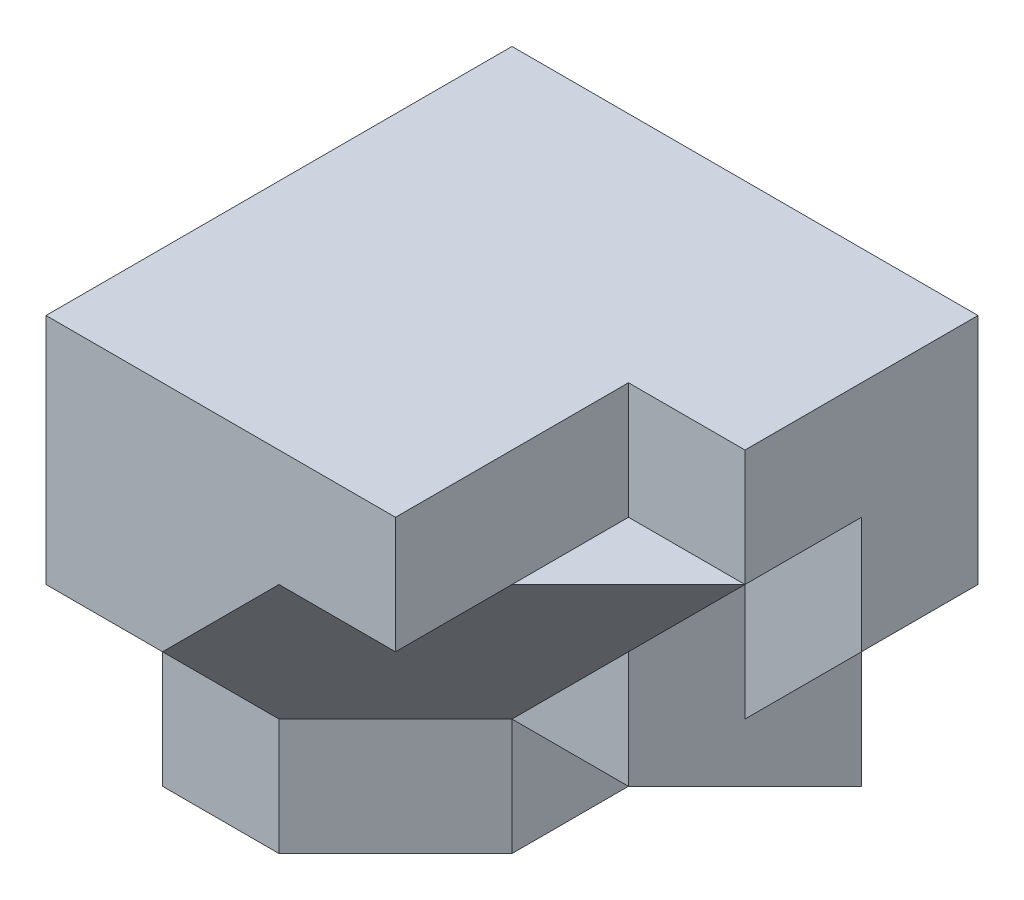
ISO-10303-21;
HEADER;
FILE_DESCRIPTION(('STEP AP214'),'2;1');
FILE_NAME('part.step','',(''),(''),'','','');
FILE_SCHEMA(('AUTOMOTIVE_DESIGN { 1 0 10303 214 1 1 1 1 }'));
ENDSEC;
DATA;
#1=APPLICATION_CONTEXT('core data for automotive mechanical design processes');
#2=APPLICATION_PROTOCOL_DEFINITION('international standard','automotive_design',2000,#1);
#3=PRODUCT_CONTEXT('',#1,'mechanical');
#4=PRODUCT('Part','Part','',(#3));
#5=PRODUCT_RELATED_PRODUCT_CATEGORY('part','',(#4));
#6=PRODUCT_DEFINITION_FORMATION('','',#4);
#7=PRODUCT_DEFINITION_CONTEXT('part definition',#1,'design');
#8=PRODUCT_DEFINITION('design','',#6,#7);
#9=PRODUCT_DEFINITION_SHAPE('','',#8);
#10=(LENGTH_UNIT() NAMED_UNIT(*) SI_UNIT(.MILLI.,.METRE.));
#11=(NAMED_UNIT(*) PLANE_ANGLE_UNIT() SI_UNIT($,.RADIAN.));
#12=(NAMED_UNIT(*) SI_UNIT($,.STERADIAN.) SOLID_ANGLE_UNIT());
#13=UNCERTAINTY_MEASURE_WITH_UNIT(LENGTH_MEASURE(1.E-05),#10,'distance_accuracy_value','');
#14=(GEOMETRIC_REPRESENTATION_CONTEXT(3) GLOBAL_UNCERTAINTY_ASSIGNED_CONTEXT((#13)) GLOBAL_UNIT_ASSIGNED_CONTEXT((#10,
#11,#12)) REPRESENTATION_CONTEXT('',''));
#15=CARTESIAN_POINT('',(0.,0.,0.));
#16=DIRECTION('',(0.,0.,1.));
#17=DIRECTION('',(1.,0.,0.));
#18=AXIS2_PLACEMENT_3D('',#15,#16,#17);
#19=CARTESIAN_POINT('',(0.,30.,40.));
#20=DIRECTION('',(0.,1.,0.));
#21=DIRECTION('',(0.,0.,1.));
#22=AXIS2_PLACEMENT_3D('',#19,#20,#21);
#23=PLANE('',#22);
#24=DIRECTION('',(0.707106781186547,0.,-0.707106781186548));
#25=VECTOR('',#24,1.);
#26=CARTESIAN_POINT('',(40.,30.,20.));
#27=LINE('',#26,#25);
#28=CARTESIAN_POINT('',(20.,30.,40.));
#29=VERTEX_POINT('',#28);
#30=CARTESIAN_POINT('',(30.,30.,30.));
#31=VERTEX_POINT('',#30);
#32=EDGE_CURVE('E168',#29,#31,#27,.T.);
#33=ORIENTED_EDGE('',*,*,#32,.T.);
#34=DIRECTION('',(0.,0.,-1.));
#35=VECTOR('',#34,1.);
#36=CARTESIAN_POINT('',(30.,30.,40.));
#37=LINE('',#36,#35);
#38=CARTESIAN_POINT('',(30.,30.,40.));
#39=VERTEX_POINT('',#38);
#40=EDGE_CURVE('E247',#39,#31,#37,.T.);
#41=ORIENTED_EDGE('',*,*,#40,.F.);
#42=DIRECTION('',(1.,0.,0.));
#43=VECTOR('',#42,1.);
#44=CARTESIAN_POINT('',(0.,30.,40.));
#45=LINE('',#44,#43);
#46=EDGE_CURVE('E249',#29,#39,#45,.T.);
#47=ORIENTED_EDGE('',*,*,#46,.F.);
#48=EDGE_LOOP('',(#33,#41,#47));
#49=FACE_BOUND('',#48,.T.);
#50=ADVANCED_FACE('F36',(#49),#23,.F.);
#51=CARTESIAN_POINT('',(0.,0.,20.));
#52=DIRECTION('',(0.,0.,-1.));
#53=DIRECTION('',(-1.,0.,0.));
#54=AXIS2_PLACEMENT_3D('',#51,#52,#53);
#55=PLANE('',#54);
#56=DIRECTION('',(-0.707106781186547,-0.707106781186548,0.));
#57=VECTOR('',#56,1.);
#58=CARTESIAN_POINT('',(5.00000000000001,-5.00000000000001,20.));
#59=LINE('',#58,#57);
#60=CARTESIAN_POINT('',(30.,20.,20.));
#61=VERTEX_POINT('',#60);
#62=CARTESIAN_POINT('',(20.,9.99999999999999,20.));
#63=VERTEX_POINT('',#62);
#64=EDGE_CURVE('E196',#61,#63,#59,.T.);
#65=ORIENTED_EDGE('',*,*,#64,.T.);
#66=DIRECTION('',(-1.,0.,0.));
#67=VECTOR('',#66,1.);
#68=CARTESIAN_POINT('',(30.,10.,20.));
#69=LINE('',#68,#67);
#70=CARTESIAN_POINT('',(30.,10.,20.));
#71=VERTEX_POINT('',#70);
#72=EDGE_CURVE('E284',#71,#63,#69,.T.);
#73=ORIENTED_EDGE('',*,*,#72,.F.);
#74=DIRECTION('',(0.,1.,0.));
#75=VECTOR('',#74,1.);
#76=CARTESIAN_POINT('',(30.,10.,20.));
#77=LINE('',#76,#75);
#78=EDGE_CURVE('E270',#71,#61,#77,.T.);
#79=ORIENTED_EDGE('',*,*,#78,.T.);
#80=EDGE_LOOP('',(#65,#73,#79));
#81=FACE_BOUND('',#80,.T.);
#82=ADVANCED_FACE('F351',(#81),#55,.F.);
#83=CARTESIAN_POINT('',(5.,-5.,0.));
#84=DIRECTION('',(0.707106781186548,-0.707106781186548,0.));
#85=DIRECTION('',(0.707106781186548,0.707106781186548,0.));
#86=AXIS2_PLACEMENT_3D('',#83,#84,#85);
#87=PLANE('',#86);
#88=DIRECTION('',(0.,0.,1.));
#89=VECTOR('',#88,1.);
#90=CARTESIAN_POINT('',(30.,20.,0.));
#91=LINE('',#90,#89);
#92=CARTESIAN_POINT('',(30.,20.,10.));
#93=VERTEX_POINT('',#92);
#94=EDGE_CURVE('E274',#93,#61,#91,.T.);
#95=ORIENTED_EDGE('',*,*,#94,.F.);
#96=DIRECTION('',(0.707106781186548,0.707106781186547,0.));
#97=VECTOR('',#96,1.);
#98=CARTESIAN_POINT('',(30.,20.,10.));
#99=LINE('',#98,#97);
#100=CARTESIAN_POINT('',(40.,30.,10.));
#101=VERTEX_POINT('',#100);
#102=EDGE_CURVE('E52',#93,#101,#99,.T.);
#103=ORIENTED_EDGE('',*,*,#102,.T.);
#104=DIRECTION('',(0.,0.,1.));
#105=VECTOR('',#104,1.);
#106=CARTESIAN_POINT('',(40.,30.,0.));
#107=LINE('',#106,#105);
#108=CARTESIAN_POINT('',(40.,30.,20.));
#109=VERTEX_POINT('',#108);
#110=EDGE_CURVE('E183',#101,#109,#107,.T.);
#111=ORIENTED_EDGE('',*,*,#110,.T.);
#112=DIRECTION('',(0.707106781186548,0.707106781186548,0.));
#113=VECTOR('',#112,1.);
#114=CARTESIAN_POINT('',(5.,-5.,20.));
#115=LINE('',#114,#113);
#116=EDGE_CURVE('E189',#61,#109,#115,.T.);
#117=ORIENTED_EDGE('',*,*,#116,.F.);
#118=EDGE_LOOP('',(#95,#103,#111,#117));
#119=FACE_BOUND('',#118,.T.);
#120=ADVANCED_FACE('F188',(#119),#87,.T.);
#121=CARTESIAN_POINT('',(20.,0.,0.));
#122=DIRECTION('',(1.,0.,0.));
#123=DIRECTION('',(0.,0.,-1.));
#124=AXIS2_PLACEMENT_3D('',#121,#122,#123);
#125=PLANE('',#124);
#126=DIRECTION('',(0.,0.,1.));
#127=VECTOR('',#126,1.);
#128=CARTESIAN_POINT('',(20.,0.,0.));
#129=LINE('',#128,#127);
#130=CARTESIAN_POINT('',(20.,0.,0.));
#131=VERTEX_POINT('',#130);
#132=CARTESIAN_POINT('',(20.,0.,20.));
#133=VERTEX_POINT('',#132);
#134=EDGE_CURVE('E191',#131,#133,#129,.T.);
#135=ORIENTED_EDGE('',*,*,#134,.F.);
#136=DIRECTION('',(0.,-0.447213595499958,-0.894427190999916));
#137=VECTOR('',#136,1.);
#138=CARTESIAN_POINT('',(20.,0.,0.));
#139=LINE('',#138,#137);
#140=EDGE_CURVE('E276',#63,#131,#139,.T.);
#141=ORIENTED_EDGE('',*,*,#140,.F.);
#142=DIRECTION('',(0.,1.,0.));
#143=VECTOR('',#142,1.);
#144=CARTESIAN_POINT('',(20.,0.,20.));
#145=LINE('',#144,#143);
#146=EDGE_CURVE('E198',#133,#63,#145,.T.);
#147=ORIENTED_EDGE('',*,*,#146,.F.);
#148=EDGE_LOOP('',(#135,#141,#147));
#149=FACE_BOUND('',#148,.T.);
#150=ADVANCED_FACE('F392',(#149),#125,.T.);
#151=CARTESIAN_POINT('',(0.,0.,20.));
#152=DIRECTION('',(0.,1.,0.));
#153=DIRECTION('',(0.,0.,1.));
#154=AXIS2_PLACEMENT_3D('',#151,#152,#153);
#155=PLANE('',#154);
#156=ORIENTED_EDGE('',*,*,#134,.T.);
#157=DIRECTION('',(-0.707106781186548,0.,0.707106781186547));
#158=VECTOR('',#157,1.);
#159=CARTESIAN_POINT('',(10.,0.,30.));
#160=LINE('',#159,#158);
#161=CARTESIAN_POINT('',(10.,0.,30.));
#162=VERTEX_POINT('',#161);
#163=EDGE_CURVE('E287',#133,#162,#160,.T.);
#164=ORIENTED_EDGE('',*,*,#163,.T.);
#165=DIRECTION('',(-1.,0.,0.));
#166=VECTOR('',#165,1.);
#167=CARTESIAN_POINT('',(0.,0.,30.));
#168=LINE('',#167,#166);
#169=CARTESIAN_POINT('',(0.,0.,30.));
#170=VERTEX_POINT('',#169);
#171=EDGE_CURVE('E292',#162,#170,#168,.T.);
#172=ORIENTED_EDGE('',*,*,#171,.T.);
#173=DIRECTION('',(0.,0.,-1.));
#174=VECTOR('',#173,1.);
#175=CARTESIAN_POINT('',(0.,0.,20.));
#176=LINE('',#175,#174);
#177=CARTESIAN_POINT('',(0.,0.,0.));
#178=VERTEX_POINT('',#177);
#179=EDGE_CURVE('E11',#170,#178,#176,.T.);
#180=ORIENTED_EDGE('',*,*,#179,.T.);
#181=DIRECTION('',(1.,0.,0.));
#182=VECTOR('',#181,1.);
#183=CARTESIAN_POINT('',(0.,0.,0.));
#184=LINE('',#183,#182);
#185=EDGE_CURVE('E212',#178,#131,#184,.T.);
#186=ORIENTED_EDGE('',*,*,#185,.T.);
#187=EDGE_LOOP('',(#156,#164,#172,#180,#186));
#188=FACE_BOUND('',#187,.T.);
#189=ADVANCED_FACE('F300',(#188),#155,.F.);
#190=CARTESIAN_POINT('',(40.,0.,20.));
#191=DIRECTION('',(-1.,0.,0.));
#192=DIRECTION('',(0.,0.,1.));
#193=AXIS2_PLACEMENT_3D('',#190,#191,#192);
#194=PLANE('',#193);
#195=DIRECTION('',(0.,0.,-1.));
#196=VECTOR('',#195,1.);
#197=CARTESIAN_POINT('',(40.,40.,20.));
#198=LINE('',#197,#196);
#199=CARTESIAN_POINT('',(40.,40.,20.));
#200=VERTEX_POINT('',#199);
#201=CARTESIAN_POINT('',(40.,40.,0.));
#202=VERTEX_POINT('',#201);
#203=EDGE_CURVE('E45',#200,#202,#198,.T.);
#204=ORIENTED_EDGE('',*,*,#203,.F.);
#205=DIRECTION('',(0.,1.,0.));
#206=VECTOR('',#205,1.);
#207=CARTESIAN_POINT('',(40.,30.,20.));
#208=LINE('',#207,#206);
#209=EDGE_CURVE('E169',#109,#200,#208,.T.);
#210=ORIENTED_EDGE('',*,*,#209,.F.);
#211=ORIENTED_EDGE('',*,*,#110,.F.);
#212=DIRECTION('',(0.,-1.,0.));
#213=VECTOR('',#212,1.);
#214=CARTESIAN_POINT('',(40.,20.,10.));
#215=LINE('',#214,#213);
#216=CARTESIAN_POINT('',(40.,20.,10.));
#217=VERTEX_POINT('',#216);
#218=EDGE_CURVE('E263',#101,#217,#215,.T.);
#219=ORIENTED_EDGE('',*,*,#218,.T.);
#220=DIRECTION('',(0.,0.,-1.));
#221=VECTOR('',#220,1.);
#222=CARTESIAN_POINT('',(40.,20.,10.));
#223=LINE('',#222,#221);
#224=CARTESIAN_POINT('',(40.,20.,0.));
#225=VERTEX_POINT('',#224);
#226=EDGE_CURVE('E228',#217,#225,#223,.T.);
#227=ORIENTED_EDGE('',*,*,#226,.T.);
#228=DIRECTION('',(0.,1.,0.));
#229=VECTOR('',#228,1.);
#230=CARTESIAN_POINT('',(40.,0.,0.));
#231=LINE('',#230,#229);
#232=EDGE_CURVE('E215',#225,#202,#231,.T.);
#233=ORIENTED_EDGE('',*,*,#232,.T.);
#234=EDGE_LOOP('',(#204,#210,#211,#219,#227,#233));
#235=FACE_BOUND('',#234,.T.);
#236=ADVANCED_FACE('F181',(#235),#194,.F.);
#237=CARTESIAN_POINT('',(0.,0.,0.));
#238=DIRECTION('',(0.,0.,-1.));
#239=DIRECTION('',(-1.,0.,0.));
#240=AXIS2_PLACEMENT_3D('',#237,#238,#239);
#241=PLANE('',#240);
#242=ORIENTED_EDGE('',*,*,#232,.F.);
#243=DIRECTION('',(-0.707106781186548,-0.707106781186547,0.));
#244=VECTOR('',#243,1.);
#245=CARTESIAN_POINT('',(30.,10.,0.));
#246=LINE('',#245,#244);
#247=CARTESIAN_POINT('',(30.,10.,0.));
#248=VERTEX_POINT('',#247);
#249=EDGE_CURVE('E259',#225,#248,#246,.T.);
#250=ORIENTED_EDGE('',*,*,#249,.T.);
#251=DIRECTION('',(0.,1.,0.));
#252=VECTOR('',#251,1.);
#253=CARTESIAN_POINT('',(30.,10.,0.));
#254=LINE('',#253,#252);
#255=CARTESIAN_POINT('',(30.,0.,0.));
#256=VERTEX_POINT('',#255);
#257=EDGE_CURVE('E277',#256,#248,#254,.T.);
#258=ORIENTED_EDGE('',*,*,#257,.F.);
#259=DIRECTION('',(-1.,0.,0.));
#260=VECTOR('',#259,1.);
#261=CARTESIAN_POINT('',(30.,0.,0.));
#262=LINE('',#261,#260);
#263=EDGE_CURVE('E281',#256,#131,#262,.T.);
#264=ORIENTED_EDGE('',*,*,#263,.T.);
#265=ORIENTED_EDGE('',*,*,#185,.F.);
#266=DIRECTION('',(0.,-1.,0.));
#267=VECTOR('',#266,1.);
#268=CARTESIAN_POINT('',(0.,0.,0.));
#269=LINE('',#268,#267);
#270=CARTESIAN_POINT('',(0.,40.,0.));
#271=VERTEX_POINT('',#270);
#272=EDGE_CURVE('E190',#271,#178,#269,.T.);
#273=ORIENTED_EDGE('',*,*,#272,.F.);
#274=DIRECTION('',(-1.,0.,0.));
#275=VECTOR('',#274,1.);
#276=CARTESIAN_POINT('',(0.,40.,0.));
#277=LINE('',#276,#275);
#278=EDGE_CURVE('E217',#202,#271,#277,.T.);
#279=ORIENTED_EDGE('',*,*,#278,.F.);
#280=EDGE_LOOP('',(#242,#250,#258,#264,#265,#273,#279));
#281=FACE_BOUND('',#280,.T.);
#282=ADVANCED_FACE('F232',(#281),#241,.T.);
#283=CARTESIAN_POINT('',(0.,0.,20.));
#284=DIRECTION('',(1.,0.,0.));
#285=DIRECTION('',(0.,0.,-1.));
#286=AXIS2_PLACEMENT_3D('',#283,#284,#285);
#287=PLANE('',#286);
#288=DIRECTION('',(0.,-1.,0.));
#289=VECTOR('',#288,1.);
#290=CARTESIAN_POINT('',(0.,10.,30.));
#291=LINE('',#290,#289);
#292=CARTESIAN_POINT('',(0.,10.,30.));
#293=VERTEX_POINT('',#292);
#294=EDGE_CURVE('E199',#293,#170,#291,.T.);
#295=ORIENTED_EDGE('',*,*,#294,.F.);
#296=DIRECTION('',(0.,-0.707106781186548,-0.707106781186548));
#297=VECTOR('',#296,1.);
#298=CARTESIAN_POINT('',(0.,10.,30.));
#299=LINE('',#298,#297);
#300=CARTESIAN_POINT('',(0.,20.,40.));
#301=VERTEX_POINT('',#300);
#302=EDGE_CURVE('E304',#301,#293,#299,.T.);
#303=ORIENTED_EDGE('',*,*,#302,.F.);
#304=DIRECTION('',(0.,-1.,0.));
#305=VECTOR('',#304,1.);
#306=CARTESIAN_POINT('',(0.,40.,40.));
#307=LINE('',#306,#305);
#308=CARTESIAN_POINT('',(0.,40.,40.));
#309=VERTEX_POINT('',#308);
#310=EDGE_CURVE('E239',#309,#301,#307,.T.);
#311=ORIENTED_EDGE('',*,*,#310,.F.);
#312=DIRECTION('',(0.,0.,-1.));
#313=VECTOR('',#312,1.);
#314=CARTESIAN_POINT('',(0.,40.,20.));
#315=LINE('',#314,#313);
#316=EDGE_CURVE('E220',#309,#271,#315,.T.);
#317=ORIENTED_EDGE('',*,*,#316,.T.);
#318=ORIENTED_EDGE('',*,*,#272,.T.);
#319=ORIENTED_EDGE('',*,*,#179,.F.);
#320=EDGE_LOOP('',(#295,#303,#311,#317,#318,#319));
#321=FACE_BOUND('',#320,.T.);
#322=ADVANCED_FACE('F38',(#321),#287,.F.);
#323=CARTESIAN_POINT('',(0.,40.,20.));
#324=DIRECTION('',(0.,-1.,0.));
#325=DIRECTION('',(0.,0.,-1.));
#326=AXIS2_PLACEMENT_3D('',#323,#324,#325);
#327=PLANE('',#326);
#328=DIRECTION('',(0.,0.,-1.));
#329=VECTOR('',#328,1.);
#330=CARTESIAN_POINT('',(30.,40.,40.));
#331=LINE('',#330,#329);
#332=CARTESIAN_POINT('',(30.,40.,40.));
#333=VERTEX_POINT('',#332);
#334=CARTESIAN_POINT('',(30.,40.,20.));
#335=VERTEX_POINT('',#334);
#336=EDGE_CURVE('E243',#333,#335,#331,.T.);
#337=ORIENTED_EDGE('',*,*,#336,.T.);
#338=DIRECTION('',(-1.,0.,0.));
#339=VECTOR('',#338,1.);
#340=CARTESIAN_POINT('',(30.,40.,20.));
#341=LINE('',#340,#339);
#342=EDGE_CURVE('E226',#200,#335,#341,.T.);
#343=ORIENTED_EDGE('',*,*,#342,.F.);
#344=ORIENTED_EDGE('',*,*,#203,.T.);
#345=ORIENTED_EDGE('',*,*,#278,.T.);
#346=ORIENTED_EDGE('',*,*,#316,.F.);
#347=DIRECTION('',(-1.,0.,0.));
#348=VECTOR('',#347,1.);
#349=CARTESIAN_POINT('',(0.,40.,40.));
#350=LINE('',#349,#348);
#351=EDGE_CURVE('E241',#333,#309,#350,.T.);
#352=ORIENTED_EDGE('',*,*,#351,.F.);
#353=EDGE_LOOP('',(#337,#343,#344,#345,#346,#352));
#354=FACE_BOUND('',#353,.T.);
#355=ADVANCED_FACE('F222',(#354),#327,.F.);
#356=CARTESIAN_POINT('',(10.,10.,30.));
#357=DIRECTION('',(0.707106781186547,0.,0.707106781186548));
#358=DIRECTION('',(0.707106781186548,0.,-0.707106781186547));
#359=AXIS2_PLACEMENT_3D('',#356,#357,#358);
#360=PLANE('',#359);
#361=ORIENTED_EDGE('',*,*,#163,.F.);
#362=ORIENTED_EDGE('',*,*,#146,.T.);
#363=DIRECTION('',(-0.707106781186548,0.,0.707106781186547));
#364=VECTOR('',#363,1.);
#365=CARTESIAN_POINT('',(10.,10.,30.));
#366=LINE('',#365,#364);
#367=CARTESIAN_POINT('',(10.,10.,30.));
#368=VERTEX_POINT('',#367);
#369=EDGE_CURVE('E288',#63,#368,#366,.T.);
#370=ORIENTED_EDGE('',*,*,#369,.T.);
#371=DIRECTION('',(0.,-1.,0.));
#372=VECTOR('',#371,1.);
#373=CARTESIAN_POINT('',(10.,10.,30.));
#374=LINE('',#373,#372);
#375=EDGE_CURVE('E204',#368,#162,#374,.T.);
#376=ORIENTED_EDGE('',*,*,#375,.T.);
#377=EDGE_LOOP('',(#361,#362,#370,#376));
#378=FACE_BOUND('',#377,.T.);
#379=ADVANCED_FACE('F389',(#378),#360,.T.);
#380=CARTESIAN_POINT('',(0.,10.,30.));
#381=DIRECTION('',(0.,0.,1.));
#382=DIRECTION('',(1.,0.,0.));
#383=AXIS2_PLACEMENT_3D('',#380,#381,#382);
#384=PLANE('',#383);
#385=ORIENTED_EDGE('',*,*,#171,.F.);
#386=ORIENTED_EDGE('',*,*,#375,.F.);
#387=DIRECTION('',(-1.,0.,0.));
#388=VECTOR('',#387,1.);
#389=CARTESIAN_POINT('',(0.,10.,30.));
#390=LINE('',#389,#388);
#391=EDGE_CURVE('E291',#368,#293,#390,.T.);
#392=ORIENTED_EDGE('',*,*,#391,.T.);
#393=ORIENTED_EDGE('',*,*,#294,.T.);
#394=EDGE_LOOP('',(#385,#386,#392,#393));
#395=FACE_BOUND('',#394,.T.);
#396=ADVANCED_FACE('F303',(#395),#384,.T.);
#397=CARTESIAN_POINT('',(30.,0.,0.));
#398=DIRECTION('',(0.,0.894427190999916,-0.447213595499958));
#399=DIRECTION('',(0.,0.447213595499958,0.894427190999916));
#400=AXIS2_PLACEMENT_3D('',#397,#398,#399);
#401=PLANE('',#400);
#402=ORIENTED_EDGE('',*,*,#140,.T.);
#403=ORIENTED_EDGE('',*,*,#263,.F.);
#404=DIRECTION('',(0.,-0.447213595499958,-0.894427190999916));
#405=VECTOR('',#404,1.);
#406=CARTESIAN_POINT('',(30.,0.,0.));
#407=LINE('',#406,#405);
#408=EDGE_CURVE('E279',#71,#256,#407,.T.);
#409=ORIENTED_EDGE('',*,*,#408,.F.);
#410=ORIENTED_EDGE('',*,*,#72,.T.);
#411=EDGE_LOOP('',(#402,#403,#409,#410));
#412=FACE_BOUND('',#411,.T.);
#413=ADVANCED_FACE('F407',(#412),#401,.F.);
#414=CARTESIAN_POINT('',(30.,0.,0.));
#415=DIRECTION('',(1.,0.,0.));
#416=DIRECTION('',(0.,0.,-1.));
#417=AXIS2_PLACEMENT_3D('',#414,#415,#416);
#418=PLANE('',#417);
#419=DIRECTION('',(0.,0.,-1.));
#420=VECTOR('',#419,1.);
#421=CARTESIAN_POINT('',(30.,10.,10.));
#422=LINE('',#421,#420);
#423=CARTESIAN_POINT('',(30.,10.,10.));
#424=VERTEX_POINT('',#423);
#425=EDGE_CURVE('E60',#424,#248,#422,.T.);
#426=ORIENTED_EDGE('',*,*,#425,.F.);
#427=DIRECTION('',(0.,1.,0.));
#428=VECTOR('',#427,1.);
#429=CARTESIAN_POINT('',(30.,10.,10.));
#430=LINE('',#429,#428);
#431=EDGE_CURVE('E260',#424,#93,#430,.T.);
#432=ORIENTED_EDGE('',*,*,#431,.T.);
#433=ORIENTED_EDGE('',*,*,#94,.T.);
#434=ORIENTED_EDGE('',*,*,#78,.F.);
#435=ORIENTED_EDGE('',*,*,#408,.T.);
#436=ORIENTED_EDGE('',*,*,#257,.T.);
#437=EDGE_LOOP('',(#426,#432,#433,#434,#435,#436));
#438=FACE_BOUND('',#437,.T.);
#439=ADVANCED_FACE('F410',(#438),#418,.T.);
#440=CARTESIAN_POINT('',(30.,10.,10.));
#441=DIRECTION('',(0.707106781186547,-0.707106781186548,0.));
#442=DIRECTION('',(0.707106781186548,0.707106781186547,0.));
#443=AXIS2_PLACEMENT_3D('',#440,#441,#442);
#444=PLANE('',#443);
#445=ORIENTED_EDGE('',*,*,#249,.F.);
#446=ORIENTED_EDGE('',*,*,#226,.F.);
#447=DIRECTION('',(-0.707106781186548,-0.707106781186547,0.));
#448=VECTOR('',#447,1.);
#449=CARTESIAN_POINT('',(30.,10.,10.));
#450=LINE('',#449,#448);
#451=EDGE_CURVE('E265',#217,#424,#450,.T.);
#452=ORIENTED_EDGE('',*,*,#451,.T.);
#453=ORIENTED_EDGE('',*,*,#425,.T.);
#454=EDGE_LOOP('',(#445,#446,#452,#453));
#455=FACE_BOUND('',#454,.T.);
#456=ADVANCED_FACE('F414',(#455),#444,.T.);
#457=CARTESIAN_POINT('',(0.,0.,10.));
#458=DIRECTION('',(0.,0.,-1.));
#459=DIRECTION('',(-1.,0.,0.));
#460=AXIS2_PLACEMENT_3D('',#457,#458,#459);
#461=PLANE('',#460);
#462=ORIENTED_EDGE('',*,*,#431,.F.);
#463=ORIENTED_EDGE('',*,*,#451,.F.);
#464=ORIENTED_EDGE('',*,*,#218,.F.);
#465=ORIENTED_EDGE('',*,*,#102,.F.);
#466=EDGE_LOOP('',(#462,#463,#464,#465));
#467=FACE_BOUND('',#466,.T.);
#468=ADVANCED_FACE('F416',(#467),#461,.F.);
#469=CARTESIAN_POINT('',(30.,40.,40.));
#470=DIRECTION('',(-1.,0.,0.));
#471=DIRECTION('',(0.,0.,1.));
#472=AXIS2_PLACEMENT_3D('',#469,#470,#471);
#473=PLANE('',#472);
#474=ORIENTED_EDGE('',*,*,#40,.T.);
#475=DIRECTION('',(0.,0.,1.));
#476=VECTOR('',#475,1.);
#477=CARTESIAN_POINT('',(30.,30.,30.));
#478=LINE('',#477,#476);
#479=CARTESIAN_POINT('',(30.,30.,20.));
#480=VERTEX_POINT('',#479);
#481=EDGE_CURVE('E163',#480,#31,#478,.T.);
#482=ORIENTED_EDGE('',*,*,#481,.F.);
#483=DIRECTION('',(0.,1.,0.));
#484=VECTOR('',#483,1.);
#485=CARTESIAN_POINT('',(30.,30.,20.));
#486=LINE('',#485,#484);
#487=EDGE_CURVE('E177',#480,#335,#486,.T.);
#488=ORIENTED_EDGE('',*,*,#487,.T.);
#489=ORIENTED_EDGE('',*,*,#336,.F.);
#490=DIRECTION('',(0.,1.,0.));
#491=VECTOR('',#490,1.);
#492=CARTESIAN_POINT('',(30.,40.,40.));
#493=LINE('',#492,#491);
#494=EDGE_CURVE('E245',#39,#333,#493,.T.);
#495=ORIENTED_EDGE('',*,*,#494,.F.);
#496=EDGE_LOOP('',(#474,#482,#488,#489,#495));
#497=FACE_BOUND('',#496,.T.);
#498=ADVANCED_FACE('F334',(#497),#473,.F.);
#499=CARTESIAN_POINT('',(0.,0.,40.));
#500=DIRECTION('',(0.,0.,1.));
#501=DIRECTION('',(1.,0.,0.));
#502=AXIS2_PLACEMENT_3D('',#499,#500,#501);
#503=PLANE('',#502);
#504=DIRECTION('',(-1.,0.,0.));
#505=VECTOR('',#504,1.);
#506=CARTESIAN_POINT('',(30.,20.,40.));
#507=LINE('',#506,#505);
#508=CARTESIAN_POINT('',(10.,20.,40.));
#509=VERTEX_POINT('',#508);
#510=EDGE_CURVE('E306',#509,#301,#507,.T.);
#511=ORIENTED_EDGE('',*,*,#510,.F.);
#512=DIRECTION('',(0.707106781186547,0.707106781186548,0.));
#513=VECTOR('',#512,1.);
#514=CARTESIAN_POINT('',(20.,30.,40.));
#515=LINE('',#514,#513);
#516=EDGE_CURVE('E324',#509,#29,#515,.T.);
#517=ORIENTED_EDGE('',*,*,#516,.T.);
#518=ORIENTED_EDGE('',*,*,#46,.T.);
#519=ORIENTED_EDGE('',*,*,#494,.T.);
#520=ORIENTED_EDGE('',*,*,#351,.T.);
#521=ORIENTED_EDGE('',*,*,#310,.T.);
#522=EDGE_LOOP('',(#511,#517,#518,#519,#520,#521));
#523=FACE_BOUND('',#522,.T.);
#524=ADVANCED_FACE('F310',(#523),#503,.T.);
#525=CARTESIAN_POINT('',(10.,-10.,10.));
#526=DIRECTION('',(-0.577350269189626,0.577350269189626,-0.577350269189626));
#527=DIRECTION('',(-0.707106781186547,-0.707106781186548,0.));
#528=AXIS2_PLACEMENT_3D('',#525,#526,#527);
#529=PLANE('',#528);
#530=ORIENTED_EDGE('',*,*,#516,.F.);
#531=DIRECTION('',(0.,-0.707106781186548,-0.707106781186548));
#532=VECTOR('',#531,1.);
#533=CARTESIAN_POINT('',(10.,-10.,10.));
#534=LINE('',#533,#532);
#535=EDGE_CURVE('E326',#509,#368,#534,.T.);
#536=ORIENTED_EDGE('',*,*,#535,.T.);
#537=ORIENTED_EDGE('',*,*,#369,.F.);
#538=ORIENTED_EDGE('',*,*,#64,.F.);
#539=ORIENTED_EDGE('',*,*,#116,.T.);
#540=EDGE_CURVE('E158',#31,#109,#27,.T.);
#541=ORIENTED_EDGE('',*,*,#540,.F.);
#542=ORIENTED_EDGE('',*,*,#32,.F.);
#543=EDGE_LOOP('',(#530,#536,#537,#538,#539,#541,#542));
#544=FACE_BOUND('',#543,.T.);
#545=ADVANCED_FACE('F194',(#544),#529,.F.);
#546=CARTESIAN_POINT('',(30.,10.,30.));
#547=DIRECTION('',(0.,0.707106781186547,-0.707106781186547));
#548=DIRECTION('',(0.,0.707106781186548,0.707106781186548));
#549=AXIS2_PLACEMENT_3D('',#546,#547,#548);
#550=PLANE('',#549);
#551=ORIENTED_EDGE('',*,*,#510,.T.);
#552=ORIENTED_EDGE('',*,*,#302,.T.);
#553=ORIENTED_EDGE('',*,*,#391,.F.);
#554=ORIENTED_EDGE('',*,*,#535,.F.);
#555=EDGE_LOOP('',(#551,#552,#553,#554));
#556=FACE_BOUND('',#555,.T.);
#557=ADVANCED_FACE('F339',(#556),#550,.F.);
#558=CARTESIAN_POINT('',(0.,30.,0.));
#559=DIRECTION('',(0.,-1.,0.));
#560=DIRECTION('',(0.,0.,-1.));
#561=AXIS2_PLACEMENT_3D('',#558,#559,#560);
#562=PLANE('',#561);
#563=DIRECTION('',(-1.,0.,0.));
#564=VECTOR('',#563,1.);
#565=CARTESIAN_POINT('',(30.,30.,20.));
#566=LINE('',#565,#564);
#567=EDGE_CURVE('E161',#109,#480,#566,.T.);
#568=ORIENTED_EDGE('',*,*,#567,.T.);
#569=ORIENTED_EDGE('',*,*,#481,.T.);
#570=ORIENTED_EDGE('',*,*,#540,.T.);
#571=EDGE_LOOP('',(#568,#569,#570));
#572=FACE_BOUND('',#571,.T.);
#573=ADVANCED_FACE('F160',(#572),#562,.F.);
#574=CARTESIAN_POINT('',(30.,30.,20.));
#575=DIRECTION('',(0.,0.,-1.));
#576=DIRECTION('',(-1.,0.,0.));
#577=AXIS2_PLACEMENT_3D('',#574,#575,#576);
#578=PLANE('',#577);
#579=ORIENTED_EDGE('',*,*,#342,.T.);
#580=ORIENTED_EDGE('',*,*,#487,.F.);
#581=ORIENTED_EDGE('',*,*,#567,.F.);
#582=ORIENTED_EDGE('',*,*,#209,.T.);
#583=EDGE_LOOP('',(#579,#580,#581,#582));
#584=FACE_BOUND('',#583,.T.);
#585=ADVANCED_FACE('F174',(#584),#578,.F.);
#586=CLOSED_SHELL('',(#50,#82,#120,#150,#189,#236,#282,#322,#355,#379,#396,#413,#439,#456,#468,
#498,#524,#545,#557,#573,#585));
#587=CARTESIAN_POINT('',(20.,10.,9.61974155433154));
#588=DIRECTION('',(1.,0.,0.));
#589=DIRECTION('',(0.,0.,-1.));
#590=AXIS2_PLACEMENT_3D('',#587,#588,#589);
#591=PLANE('',#590);
#592=DIRECTION('',(0.,-1.,0.));
#593=VECTOR('',#592,1.);
#594=CARTESIAN_POINT('',(20.,0.,20.));
#595=LINE('',#594,#593);
#596=CARTESIAN_POINT('',(20.,30.,20.));
#597=VERTEX_POINT('',#596);
#598=CARTESIAN_POINT('',(20.,27.3205080756888,20.));
#599=VERTEX_POINT('',#598);
#600=EDGE_CURVE('E318',#597,#599,#595,.T.);
#601=ORIENTED_EDGE('',*,*,#600,.F.);
#602=DIRECTION('',(0.,0.,1.));
#603=VECTOR('',#602,1.);
#604=CARTESIAN_POINT('',(20.,30.,20.));
#605=LINE('',#604,#603);
#606=CARTESIAN_POINT('',(20.,30.,22.6794919243112));
#607=VERTEX_POINT('',#606);
#608=EDGE_CURVE('E255',#597,#607,#605,.T.);
#609=ORIENTED_EDGE('',*,*,#608,.T.);
#610=DIRECTION('',(0.,-0.707106781186547,-0.707106781186547));
#611=VECTOR('',#610,1.);
#612=CARTESIAN_POINT('',(20.,3.66025403784437,-3.66025403784438));
#613=LINE('',#612,#611);
#614=EDGE_CURVE('E321',#607,#599,#613,.T.);
#615=ORIENTED_EDGE('',*,*,#614,.T.);
#616=EDGE_LOOP('',(#601,#609,#615));
#617=FACE_BOUND('',#616,.T.);
#618=ADVANCED_FACE('F364',(#617),#591,.T.);
#619=DIRECTION('',(1.,0.,0.));
#620=VECTOR('',#619,1.);
#621=CARTESIAN_POINT('',(0.,30.,20.));
#622=LINE('',#621,#620);
#623=CARTESIAN_POINT('',(22.6794919243112,30.,20.));
#624=VERTEX_POINT('',#623);
#625=EDGE_CURVE('E253',#597,#624,#622,.T.);
#626=ORIENTED_EDGE('',*,*,#625,.T.);
#627=DIRECTION('',(-0.707106781186547,0.,0.707106781186548));
#628=VECTOR('',#627,1.);
#629=CARTESIAN_POINT('',(1.33974596215562,30.,41.3397459621556));
#630=LINE('',#629,#628);
#631=EDGE_CURVE('E307',#624,#607,#630,.T.);
#632=ORIENTED_EDGE('',*,*,#631,.T.);
#633=ORIENTED_EDGE('',*,*,#608,.F.);
#634=EDGE_LOOP('',(#626,#632,#633));
#635=FACE_BOUND('',#634,.T.);
#636=ADVANCED_FACE('F353',(#635),#23,.F.);
#637=CARTESIAN_POINT('',(4.22649730810375,-4.22649730810375,4.22649730810375));
#638=DIRECTION('',(-0.577350269189626,0.577350269189626,-0.577350269189626));
#639=DIRECTION('',(-0.707106781186547,-0.707106781186548,0.));
#640=AXIS2_PLACEMENT_3D('',#637,#638,#639);
#641=PLANE('',#640);
#642=ORIENTED_EDGE('',*,*,#614,.F.);
#643=ORIENTED_EDGE('',*,*,#631,.F.);
#644=DIRECTION('',(0.707106781186547,0.707106781186548,0.));
#645=VECTOR('',#644,1.);
#646=CARTESIAN_POINT('',(-3.66025403784437,3.66025403784437,20.));
#647=LINE('',#646,#645);
#648=EDGE_CURVE('E315',#599,#624,#647,.T.);
#649=ORIENTED_EDGE('',*,*,#648,.F.);
#650=EDGE_LOOP('',(#642,#643,#649));
#651=FACE_BOUND('',#650,.T.);
#652=ADVANCED_FACE('F363',(#651),#641,.T.);
#653=ORIENTED_EDGE('',*,*,#648,.T.);
#654=ORIENTED_EDGE('',*,*,#625,.F.);
#655=ORIENTED_EDGE('',*,*,#600,.T.);
#656=EDGE_LOOP('',(#653,#654,#655));
#657=FACE_BOUND('',#656,.T.);
#658=ADVANCED_FACE('F359',(#657),#55,.F.);
#659=CLOSED_SHELL('',(#618,#636,#652,#658));
#660=ORIENTED_CLOSED_SHELL('',*,#659,.T.);
#661=BREP_WITH_VOIDS('B2',#586,(#660));
#662=ADVANCED_BREP_SHAPE_REPRESENTATION('',(#18,#661),#14);
#663=SHAPE_DEFINITION_REPRESENTATION(#9,#662);
ENDSEC;
END-ISO-10303-21;
